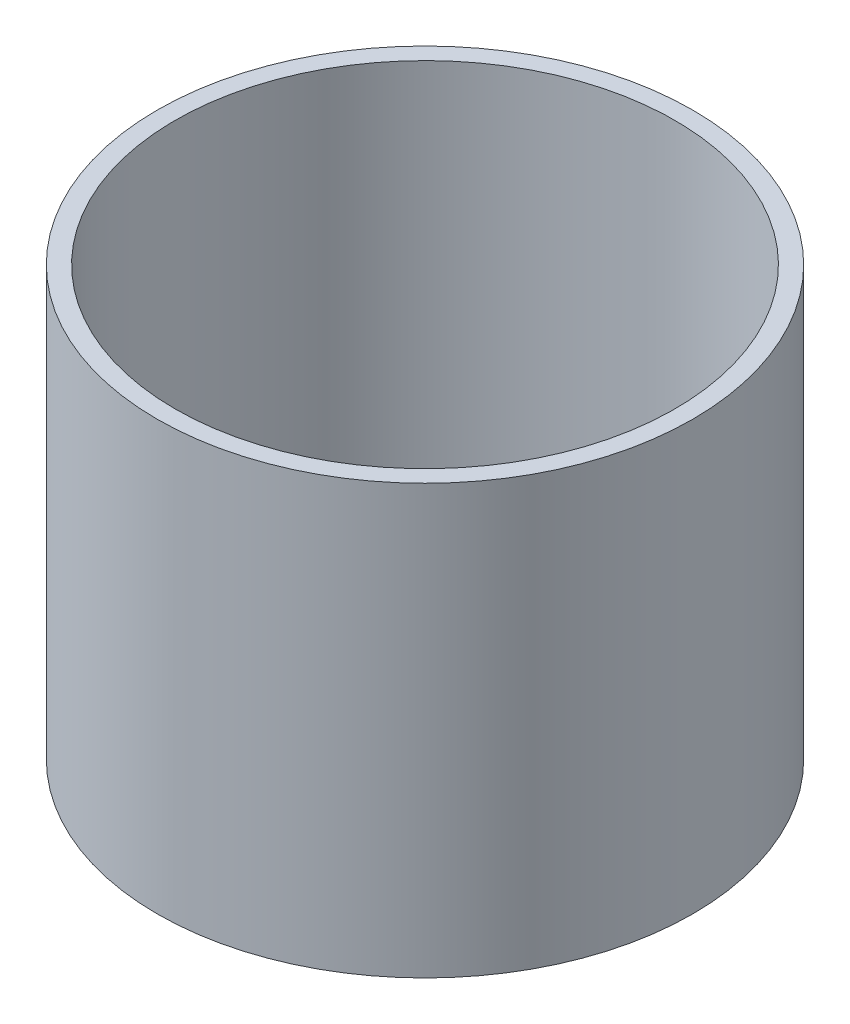
ISO-10303-21;
HEADER;
FILE_DESCRIPTION(('STEP AP214'),'2;1');
FILE_NAME('part.step','',(''),(''),'','','');
FILE_SCHEMA(('AUTOMOTIVE_DESIGN { 1 0 10303 214 1 1 1 1 }'));
ENDSEC;
DATA;
#1=APPLICATION_CONTEXT('core data for automotive mechanical design processes');
#2=APPLICATION_PROTOCOL_DEFINITION('international standard','automotive_design',2000,#1);
#3=PRODUCT_CONTEXT('',#1,'mechanical');
#4=PRODUCT('Part','Part','',(#3));
#5=PRODUCT_RELATED_PRODUCT_CATEGORY('part','',(#4));
#6=PRODUCT_DEFINITION_FORMATION('','',#4);
#7=PRODUCT_DEFINITION_CONTEXT('part definition',#1,'design');
#8=PRODUCT_DEFINITION('design','',#6,#7);
#9=PRODUCT_DEFINITION_SHAPE('','',#8);
#10=(LENGTH_UNIT() NAMED_UNIT(*) SI_UNIT(.MILLI.,.METRE.));
#11=(NAMED_UNIT(*) PLANE_ANGLE_UNIT() SI_UNIT($,.RADIAN.));
#12=(NAMED_UNIT(*) SI_UNIT($,.STERADIAN.) SOLID_ANGLE_UNIT());
#13=UNCERTAINTY_MEASURE_WITH_UNIT(LENGTH_MEASURE(1.E-05),#10,'distance_accuracy_value','');
#14=(GEOMETRIC_REPRESENTATION_CONTEXT(3) GLOBAL_UNCERTAINTY_ASSIGNED_CONTEXT((#13)) GLOBAL_UNIT_ASSIGNED_CONTEXT((#10,
#11,#12)) REPRESENTATION_CONTEXT('',''));
#15=CARTESIAN_POINT('',(0.,0.,0.));
#16=DIRECTION('',(0.,0.,1.));
#17=DIRECTION('',(1.,0.,0.));
#18=AXIS2_PLACEMENT_3D('',#15,#16,#17);
#19=CARTESIAN_POINT('',(0.,76.2,0.));
#20=DIRECTION('',(0.,1.,0.));
#21=DIRECTION('',(0.,0.,1.));
#22=AXIS2_PLACEMENT_3D('',#19,#20,#21);
#23=PLANE('',#22);
#24=CARTESIAN_POINT('',(0.,76.2,0.));
#25=DIRECTION('',(0.,1.,0.));
#26=DIRECTION('',(0.,0.,1.));
#27=AXIS2_PLACEMENT_3D('',#24,#25,#26);
#28=CIRCLE('',#27,47.625);
#29=CARTESIAN_POINT('',(0.,76.2,47.625));
#30=VERTEX_POINT('',#29);
#31=EDGE_CURVE('E10',#30,#30,#28,.T.);
#32=ORIENTED_EDGE('',*,*,#31,.T.);
#33=EDGE_LOOP('',(#32));
#34=FACE_BOUND('',#33,.T.);
#35=CARTESIAN_POINT('',(0.,76.2,0.));
#36=DIRECTION('',(0.,1.,0.));
#37=DIRECTION('',(0.,0.,1.));
#38=AXIS2_PLACEMENT_3D('',#35,#36,#37);
#39=CIRCLE('',#38,44.45);
#40=CARTESIAN_POINT('',(0.,76.2,44.45));
#41=VERTEX_POINT('',#40);
#42=EDGE_CURVE('E50',#41,#41,#39,.T.);
#43=ORIENTED_EDGE('',*,*,#42,.F.);
#44=EDGE_LOOP('',(#43));
#45=FACE_BOUND('',#44,.T.);
#46=ADVANCED_FACE('F37',(#34,#45),#23,.T.);
#47=CARTESIAN_POINT('',(0.,0.,0.));
#48=DIRECTION('',(0.,1.,0.));
#49=DIRECTION('',(0.,0.,1.));
#50=AXIS2_PLACEMENT_3D('',#47,#48,#49);
#51=PLANE('',#50);
#52=CARTESIAN_POINT('',(0.,0.,0.));
#53=DIRECTION('',(0.,1.,0.));
#54=DIRECTION('',(0.,0.,1.));
#55=AXIS2_PLACEMENT_3D('',#52,#53,#54);
#56=CIRCLE('',#55,47.625);
#57=CARTESIAN_POINT('',(0.,0.,47.625));
#58=VERTEX_POINT('',#57);
#59=EDGE_CURVE('E41',#58,#58,#56,.T.);
#60=ORIENTED_EDGE('',*,*,#59,.F.);
#61=EDGE_LOOP('',(#60));
#62=FACE_BOUND('',#61,.T.);
#63=CARTESIAN_POINT('',(0.,0.,0.));
#64=DIRECTION('',(0.,1.,0.));
#65=DIRECTION('',(0.,0.,1.));
#66=AXIS2_PLACEMENT_3D('',#63,#64,#65);
#67=CIRCLE('',#66,44.45);
#68=CARTESIAN_POINT('',(0.,0.,44.45));
#69=VERTEX_POINT('',#68);
#70=EDGE_CURVE('E52',#69,#69,#67,.T.);
#71=ORIENTED_EDGE('',*,*,#70,.T.);
#72=EDGE_LOOP('',(#71));
#73=FACE_BOUND('',#72,.T.);
#74=ADVANCED_FACE('F64',(#62,#73),#51,.F.);
#75=CARTESIAN_POINT('',(0.,76.2,0.));
#76=DIRECTION('',(0.,-1.,0.));
#77=DIRECTION('',(0.,0.,-1.));
#78=AXIS2_PLACEMENT_3D('',#75,#76,#77);
#79=CYLINDRICAL_SURFACE('',#78,47.625);
#80=ORIENTED_EDGE('',*,*,#31,.F.);
#81=EDGE_LOOP('',(#80));
#82=FACE_BOUND('',#81,.T.);
#83=ORIENTED_EDGE('',*,*,#59,.T.);
#84=EDGE_LOOP('',(#83));
#85=FACE_BOUND('',#84,.T.);
#86=ADVANCED_FACE('F39',(#82,#85),#79,.T.);
#87=CARTESIAN_POINT('',(0.,76.2,0.));
#88=DIRECTION('',(0.,-1.,0.));
#89=DIRECTION('',(0.,0.,-1.));
#90=AXIS2_PLACEMENT_3D('',#87,#88,#89);
#91=CYLINDRICAL_SURFACE('',#90,44.45);
#92=ORIENTED_EDGE('',*,*,#42,.T.);
#93=EDGE_LOOP('',(#92));
#94=FACE_BOUND('',#93,.T.);
#95=ORIENTED_EDGE('',*,*,#70,.F.);
#96=EDGE_LOOP('',(#95));
#97=FACE_BOUND('',#96,.T.);
#98=ADVANCED_FACE('F60',(#94,#97),#91,.F.);
#99=CLOSED_SHELL('',(#46,#74,#86,#98));
#100=MANIFOLD_SOLID_BREP('B2',#99);
#101=ADVANCED_BREP_SHAPE_REPRESENTATION('',(#18,#100),#14);
#102=SHAPE_DEFINITION_REPRESENTATION(#9,#101);
ENDSEC;
END-ISO-10303-21;
